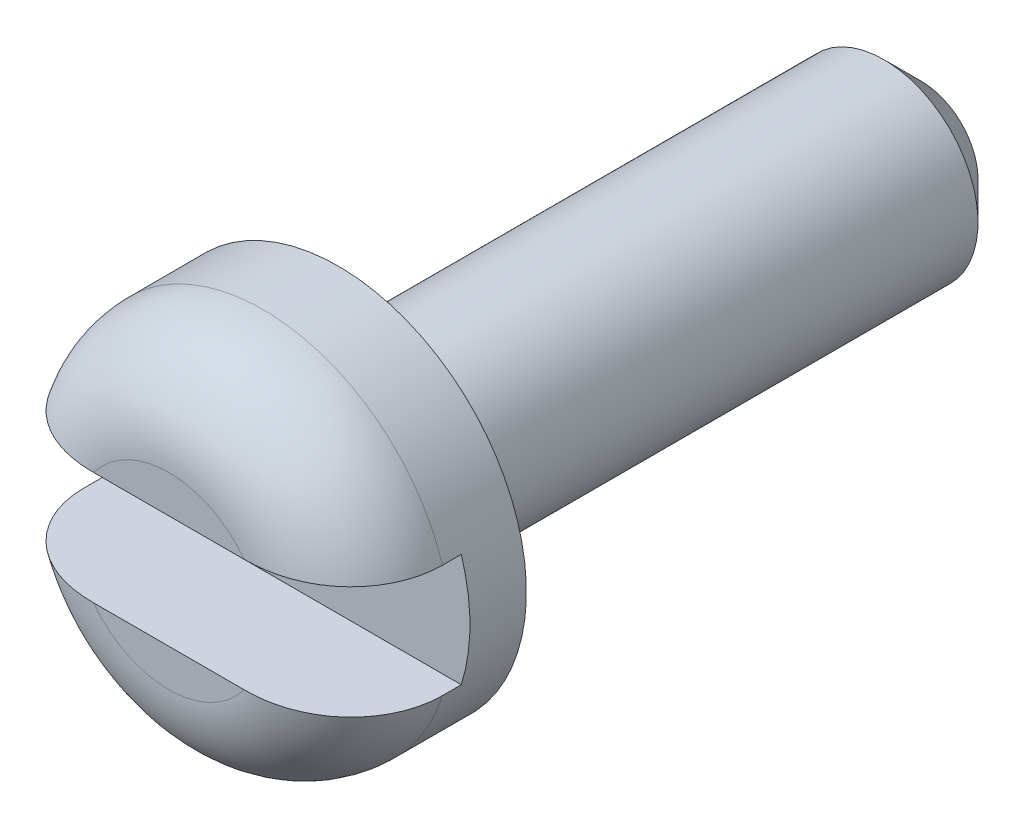
ISO-10303-21;
HEADER;
FILE_DESCRIPTION(('STEP AP214'),'2;1');
FILE_NAME('part.step','',(''),(''),'','','');
FILE_SCHEMA(('AUTOMOTIVE_DESIGN { 1 0 10303 214 1 1 1 1 }'));
ENDSEC;
DATA;
#1=APPLICATION_CONTEXT('core data for automotive mechanical design processes');
#2=APPLICATION_PROTOCOL_DEFINITION('international standard','automotive_design',2000,#1);
#3=PRODUCT_CONTEXT('',#1,'mechanical');
#4=PRODUCT('Part','Part','',(#3));
#5=PRODUCT_RELATED_PRODUCT_CATEGORY('part','',(#4));
#6=PRODUCT_DEFINITION_FORMATION('','',#4);
#7=PRODUCT_DEFINITION_CONTEXT('part definition',#1,'design');
#8=PRODUCT_DEFINITION('design','',#6,#7);
#9=PRODUCT_DEFINITION_SHAPE('','',#8);
#10=(LENGTH_UNIT() NAMED_UNIT(*) SI_UNIT(.MILLI.,.METRE.));
#11=(NAMED_UNIT(*) PLANE_ANGLE_UNIT() SI_UNIT($,.RADIAN.));
#12=(NAMED_UNIT(*) SI_UNIT($,.STERADIAN.) SOLID_ANGLE_UNIT());
#13=UNCERTAINTY_MEASURE_WITH_UNIT(LENGTH_MEASURE(1.E-05),#10,'distance_accuracy_value','');
#14=(GEOMETRIC_REPRESENTATION_CONTEXT(3) GLOBAL_UNCERTAINTY_ASSIGNED_CONTEXT((#13)) GLOBAL_UNIT_ASSIGNED_CONTEXT((#10,
#11,#12)) REPRESENTATION_CONTEXT('',''));
#15=CARTESIAN_POINT('',(0.,0.,0.));
#16=DIRECTION('',(0.,0.,1.));
#17=DIRECTION('',(1.,0.,0.));
#18=AXIS2_PLACEMENT_3D('',#15,#16,#17);
#19=CARTESIAN_POINT('',(0.,0.,0.));
#20=DIRECTION('',(0.,0.,1.));
#21=DIRECTION('',(1.,0.,0.));
#22=AXIS2_PLACEMENT_3D('',#19,#20,#21);
#23=PLANE('',#22);
#24=DIRECTION('',(1.,0.,0.));
#25=VECTOR('',#24,1.);
#26=CARTESIAN_POINT('',(-2.,-0.6,0.));
#27=LINE('',#26,#25);
#28=CARTESIAN_POINT('',(-0.8,-0.6,0.));
#29=VERTEX_POINT('',#28);
#30=CARTESIAN_POINT('',(0.8,-0.6,0.));
#31=VERTEX_POINT('',#30);
#32=EDGE_CURVE('E124',#29,#31,#27,.T.);
#33=ORIENTED_EDGE('',*,*,#32,.F.);
#34=CARTESIAN_POINT('',(0.,0.,0.));
#35=DIRECTION('',(0.,0.,1.));
#36=DIRECTION('',(1.,0.,0.));
#37=AXIS2_PLACEMENT_3D('',#34,#35,#36);
#38=CIRCLE('',#37,1.);
#39=EDGE_CURVE('E140',#29,#31,#38,.T.);
#40=ORIENTED_EDGE('',*,*,#39,.T.);
#41=EDGE_LOOP('',(#33,#40));
#42=FACE_BOUND('',#41,.T.);
#43=ADVANCED_FACE('F34',(#42),#23,.T.);
#44=DIRECTION('',(1.,0.,0.));
#45=VECTOR('',#44,1.);
#46=CARTESIAN_POINT('',(-2.,0.6,0.));
#47=LINE('',#46,#45);
#48=CARTESIAN_POINT('',(-0.8,0.6,0.));
#49=VERTEX_POINT('',#48);
#50=CARTESIAN_POINT('',(0.8,0.6,0.));
#51=VERTEX_POINT('',#50);
#52=EDGE_CURVE('E106',#49,#51,#47,.T.);
#53=ORIENTED_EDGE('',*,*,#52,.T.);
#54=CARTESIAN_POINT('',(0.,0.,0.));
#55=DIRECTION('',(0.,0.,1.));
#56=DIRECTION('',(1.,0.,0.));
#57=AXIS2_PLACEMENT_3D('',#54,#55,#56);
#58=CIRCLE('',#57,1.);
#59=EDGE_CURVE('E55',#51,#49,#58,.T.);
#60=ORIENTED_EDGE('',*,*,#59,.T.);
#61=EDGE_LOOP('',(#53,#60));
#62=FACE_BOUND('',#61,.T.);
#63=ADVANCED_FACE('F188',(#62),#23,.T.);
#64=CARTESIAN_POINT('',(0.,0.,-8.));
#65=DIRECTION('',(0.,0.,-1.));
#66=DIRECTION('',(-1.,0.,0.));
#67=AXIS2_PLACEMENT_3D('',#64,#65,#66);
#68=CYLINDRICAL_SURFACE('',#67,2.);
#69=DIRECTION('',(0.,0.,-1.));
#70=VECTOR('',#69,1.);
#71=CARTESIAN_POINT('',(1.90787840283389,-0.6,-8.));
#72=LINE('',#71,#70);
#73=CARTESIAN_POINT('',(1.90787840283389,-0.6,-0.999999999999999));
#74=VERTEX_POINT('',#73);
#75=CARTESIAN_POINT('',(1.90787840283389,-0.6,-1.2));
#76=VERTEX_POINT('',#75);
#77=EDGE_CURVE('E97',#74,#76,#72,.T.);
#78=ORIENTED_EDGE('',*,*,#77,.F.);
#79=CARTESIAN_POINT('',(0.,0.,-0.999999999999998));
#80=DIRECTION('',(0.,0.,1.));
#81=DIRECTION('',(1.,0.,0.));
#82=AXIS2_PLACEMENT_3D('',#79,#80,#81);
#83=CIRCLE('',#82,2.);
#84=CARTESIAN_POINT('',(-1.90787840283389,-0.6,-0.999999999999999));
#85=VERTEX_POINT('',#84);
#86=EDGE_CURVE('E141',#74,#85,#83,.F.);
#87=ORIENTED_EDGE('',*,*,#86,.T.);
#88=DIRECTION('',(0.,0.,-1.));
#89=VECTOR('',#88,1.);
#90=CARTESIAN_POINT('',(-1.90787840283389,-0.6,-8.));
#91=LINE('',#90,#89);
#92=CARTESIAN_POINT('',(-1.90787840283389,-0.6,-1.2));
#93=VERTEX_POINT('',#92);
#94=EDGE_CURVE('E114',#93,#85,#91,.F.);
#95=ORIENTED_EDGE('',*,*,#94,.F.);
#96=CARTESIAN_POINT('',(0.,0.,-1.2));
#97=DIRECTION('',(0.,0.,-1.));
#98=DIRECTION('',(-1.,0.,0.));
#99=AXIS2_PLACEMENT_3D('',#96,#97,#98);
#100=CIRCLE('',#99,2.);
#101=CARTESIAN_POINT('',(-1.90787840283389,0.6,-1.2));
#102=VERTEX_POINT('',#101);
#103=EDGE_CURVE('E98',#102,#93,#100,.F.);
#104=ORIENTED_EDGE('',*,*,#103,.F.);
#105=DIRECTION('',(0.,0.,-1.));
#106=VECTOR('',#105,1.);
#107=CARTESIAN_POINT('',(-1.90787840283389,0.6,-8.));
#108=LINE('',#107,#106);
#109=CARTESIAN_POINT('',(-1.90787840283389,0.6,-0.999999999999999));
#110=VERTEX_POINT('',#109);
#111=EDGE_CURVE('E86',#110,#102,#108,.T.);
#112=ORIENTED_EDGE('',*,*,#111,.F.);
#113=CARTESIAN_POINT('',(0.,0.,-1.));
#114=DIRECTION('',(0.,0.,1.));
#115=DIRECTION('',(1.,0.,0.));
#116=AXIS2_PLACEMENT_3D('',#113,#114,#115);
#117=CIRCLE('',#116,2.);
#118=CARTESIAN_POINT('',(1.90787840283389,0.6,-0.999999999999999));
#119=VERTEX_POINT('',#118);
#120=EDGE_CURVE('E144',#110,#119,#117,.F.);
#121=ORIENTED_EDGE('',*,*,#120,.T.);
#122=DIRECTION('',(0.,0.,-1.));
#123=VECTOR('',#122,1.);
#124=CARTESIAN_POINT('',(1.90787840283389,0.6,-8.));
#125=LINE('',#124,#123);
#126=CARTESIAN_POINT('',(1.90787840283389,0.6,-1.2));
#127=VERTEX_POINT('',#126);
#128=EDGE_CURVE('E115',#127,#119,#125,.F.);
#129=ORIENTED_EDGE('',*,*,#128,.F.);
#130=EDGE_CURVE('E105',#76,#127,#100,.F.);
#131=ORIENTED_EDGE('',*,*,#130,.F.);
#132=EDGE_LOOP('',(#78,#87,#95,#104,#112,#121,#129,#131));
#133=FACE_BOUND('',#132,.T.);
#134=CARTESIAN_POINT('',(0.,0.,-1.8));
#135=DIRECTION('',(0.,0.,-1.));
#136=DIRECTION('',(-1.,0.,0.));
#137=AXIS2_PLACEMENT_3D('',#134,#135,#136);
#138=CIRCLE('',#137,2.);
#139=CARTESIAN_POINT('',(-2.,0.,-1.8));
#140=VERTEX_POINT('',#139);
#141=EDGE_CURVE('E119',#140,#140,#138,.T.);
#142=ORIENTED_EDGE('',*,*,#141,.F.);
#143=EDGE_LOOP('',(#142));
#144=FACE_BOUND('',#143,.T.);
#145=ADVANCED_FACE('F110',(#133,#144),#68,.T.);
#146=CARTESIAN_POINT('',(-2.,0.,-1.8));
#147=DIRECTION('',(0.,0.,-1.));
#148=DIRECTION('',(-1.,0.,0.));
#149=AXIS2_PLACEMENT_3D('',#146,#147,#148);
#150=PLANE('',#149);
#151=CARTESIAN_POINT('',(0.,0.,-1.8));
#152=DIRECTION('',(0.,0.,-1.));
#153=DIRECTION('',(-1.,0.,0.));
#154=AXIS2_PLACEMENT_3D('',#151,#152,#153);
#155=CIRCLE('',#154,1.4);
#156=CARTESIAN_POINT('',(-1.4,0.,-1.8));
#157=VERTEX_POINT('',#156);
#158=EDGE_CURVE('E11',#157,#157,#155,.F.);
#159=ORIENTED_EDGE('',*,*,#158,.T.);
#160=EDGE_LOOP('',(#159));
#161=FACE_BOUND('',#160,.T.);
#162=ORIENTED_EDGE('',*,*,#141,.T.);
#163=EDGE_LOOP('',(#162));
#164=FACE_BOUND('',#163,.T.);
#165=ADVANCED_FACE('F219',(#161,#164),#150,.T.);
#166=CARTESIAN_POINT('',(0.,0.,-8.));
#167=DIRECTION('',(0.,0.,-1.));
#168=DIRECTION('',(-1.,0.,0.));
#169=AXIS2_PLACEMENT_3D('',#166,#167,#168);
#170=CYLINDRICAL_SURFACE('',#169,1.);
#171=CARTESIAN_POINT('',(0.,0.,-2.2));
#172=DIRECTION('',(0.,0.,-1.));
#173=DIRECTION('',(-1.,0.,0.));
#174=AXIS2_PLACEMENT_3D('',#171,#172,#173);
#175=CIRCLE('',#174,1.);
#176=CARTESIAN_POINT('',(-1.,0.,-2.2));
#177=VERTEX_POINT('',#176);
#178=EDGE_CURVE('E42',#177,#177,#175,.T.);
#179=ORIENTED_EDGE('',*,*,#178,.T.);
#180=EDGE_LOOP('',(#179));
#181=FACE_BOUND('',#180,.T.);
#182=CARTESIAN_POINT('',(0.,0.,-7.6));
#183=DIRECTION('',(0.,0.,-1.));
#184=DIRECTION('',(-1.,0.,0.));
#185=AXIS2_PLACEMENT_3D('',#182,#183,#184);
#186=CIRCLE('',#185,1.);
#187=CARTESIAN_POINT('',(-0.999999999999999,0.,-7.6));
#188=VERTEX_POINT('',#187);
#189=EDGE_CURVE('E202',#188,#188,#186,.F.);
#190=ORIENTED_EDGE('',*,*,#189,.T.);
#191=EDGE_LOOP('',(#190));
#192=FACE_BOUND('',#191,.T.);
#193=ADVANCED_FACE('F214',(#181,#192),#170,.T.);
#194=CARTESIAN_POINT('',(-0.999999999999998,0.,-8.));
#195=DIRECTION('',(0.,0.,-1.));
#196=DIRECTION('',(-1.,0.,0.));
#197=AXIS2_PLACEMENT_3D('',#194,#195,#196);
#198=PLANE('',#197);
#199=CARTESIAN_POINT('',(0.,0.,-8.));
#200=DIRECTION('',(0.,0.,-1.));
#201=DIRECTION('',(-1.,0.,0.));
#202=AXIS2_PLACEMENT_3D('',#199,#200,#201);
#203=CIRCLE('',#202,0.6);
#204=CARTESIAN_POINT('',(-0.599999999999998,0.,-8.));
#205=VERTEX_POINT('',#204);
#206=EDGE_CURVE('E205',#205,#205,#203,.T.);
#207=ORIENTED_EDGE('',*,*,#206,.T.);
#208=EDGE_LOOP('',(#207));
#209=FACE_BOUND('',#208,.T.);
#210=ADVANCED_FACE('F218',(#209),#198,.T.);
#211=CARTESIAN_POINT('',(-2.,0.6,-1.2));
#212=DIRECTION('',(0.,0.,-1.));
#213=DIRECTION('',(-1.,0.,0.));
#214=AXIS2_PLACEMENT_3D('',#211,#212,#213);
#215=PLANE('',#214);
#216=DIRECTION('',(1.,0.,0.));
#217=VECTOR('',#216,1.);
#218=CARTESIAN_POINT('',(-2.,-0.6,-1.2));
#219=LINE('',#218,#217);
#220=EDGE_CURVE('E121',#93,#76,#219,.T.);
#221=ORIENTED_EDGE('',*,*,#220,.T.);
#222=ORIENTED_EDGE('',*,*,#130,.T.);
#223=DIRECTION('',(1.,0.,0.));
#224=VECTOR('',#223,1.);
#225=CARTESIAN_POINT('',(-2.,0.6,-1.2));
#226=LINE('',#225,#224);
#227=EDGE_CURVE('E89',#102,#127,#226,.T.);
#228=ORIENTED_EDGE('',*,*,#227,.F.);
#229=ORIENTED_EDGE('',*,*,#103,.T.);
#230=EDGE_LOOP('',(#221,#222,#228,#229));
#231=FACE_BOUND('',#230,.T.);
#232=ADVANCED_FACE('F102',(#231),#215,.F.);
#233=CARTESIAN_POINT('',(-2.,-0.6,0.));
#234=DIRECTION('',(0.,-1.,0.));
#235=DIRECTION('',(0.,0.,-1.));
#236=AXIS2_PLACEMENT_3D('',#233,#234,#235);
#237=PLANE('',#236);
#238=ORIENTED_EDGE('',*,*,#94,.T.);
#239=CARTESIAN_POINT('',(-1.90787840283389,-0.6,-1.));
#240=CARTESIAN_POINT('',(-1.90787854907988,-0.6,-0.972959130771586));
#241=CARTESIAN_POINT('',(-1.90672787533789,-0.6,-0.945931393585368));
#242=CARTESIAN_POINT('',(-1.90213965871633,-0.6,-0.892073352579564));
#243=CARTESIAN_POINT('',(-1.89870233629077,-0.6,-0.865243029979482));
#244=CARTESIAN_POINT('',(-1.88500553439201,-0.6,-0.785432939642535));
#245=CARTESIAN_POINT('',(-1.87136104202504,-0.6,-0.732994457844584));
#246=CARTESIAN_POINT('',(-1.83547723787583,-0.6,-0.631166383290867));
#247=CARTESIAN_POINT('',(-1.81323587663703,-0.6,-0.581777520809764));
#248=CARTESIAN_POINT('',(-1.76086428746498,-0.6,-0.487366203130675));
#249=CARTESIAN_POINT('',(-1.73073279716015,-0.6,-0.442344448223799));
#250=CARTESIAN_POINT('',(-1.66312688530897,-0.6,-0.357337576737432));
#251=CARTESIAN_POINT('',(-1.62557004752264,-0.6,-0.317418129279802));
#252=CARTESIAN_POINT('',(-1.54452503832071,-0.6,-0.244192208616092));
#253=CARTESIAN_POINT('',(-1.50103871840768,-0.6,-0.210883679067726));
#254=CARTESIAN_POINT('',(-1.40764162770773,-0.6,-0.15034951232542));
#255=CARTESIAN_POINT('',(-1.35754855323435,-0.6,-0.123405812779762));
#256=CARTESIAN_POINT('',(-1.25373724805451,-0.6,-0.0775813762054164));
#257=CARTESIAN_POINT('',(-1.20001320021334,-0.6,-0.0587139504693381));
#258=CARTESIAN_POINT('',(-1.08894741476526,-0.6,-0.028583974322069));
#259=CARTESIAN_POINT('',(-1.03154740702986,-0.6,-0.0175376622486418));
#260=CARTESIAN_POINT('',(-0.94489821676314,-0.6,-0.00681830415335212));
#261=CARTESIAN_POINT('',(-0.91596905999246,-0.6,-0.00421972325925796));
#262=CARTESIAN_POINT('',(-0.858026852466926,-0.6,-0.000809343249861463));
#263=CARTESIAN_POINT('',(-0.82901388553351,-0.6,3.8587869620577E-06));
#264=CARTESIAN_POINT('',(-0.8,-0.6,0.));
#265=B_SPLINE_CURVE_WITH_KNOTS('',3,(#239,#240,#241,#242,#243,#244,#245,#246,#247,#248,#249,
#250,#251,#252,#253,#254,#255,#256,#257,#258,#259,#260,#261,#262,#263,#264),.UNSPECIFIED.,.F.,
.F.,(4,2,2,2,2,2,2,2,2,2,2,2,4),(0.,0.0810721414036495,0.16213646783801,0.323851745437421,
0.485605599064872,0.647385348132203,0.811073248357706,0.974710152987553,1.14461630154657,
1.31480142065062,1.4895253002468,1.57661664192148,1.66363952411327),.UNSPECIFIED.);
#266=EDGE_CURVE('E134',#85,#29,#265,.T.);
#267=ORIENTED_EDGE('',*,*,#266,.T.);
#268=ORIENTED_EDGE('',*,*,#32,.T.);
#269=CARTESIAN_POINT('',(0.8,-0.6,0.));
#270=CARTESIAN_POINT('',(0.838394836130352,-0.6,1.99528027400295E-05));
#271=CARTESIAN_POINT('',(0.876818260827937,-0.6,-0.00141609976624534));
#272=CARTESIAN_POINT('',(0.953479794413814,-0.6,-0.00749671073618988));
#273=CARTESIAN_POINT('',(0.991717409766061,-0.6,-0.0121473864561444));
#274=CARTESIAN_POINT('',(1.06772952552836,-0.6,-0.0249752264162009));
#275=CARTESIAN_POINT('',(1.10550229626654,-0.6,-0.0331629090048541));
#276=CARTESIAN_POINT('',(1.18002220545577,-0.6,-0.0532083718127095));
#277=CARTESIAN_POINT('',(1.21677020491699,-0.6,-0.0650629632106258));
#278=CARTESIAN_POINT('',(1.30802367231534,-0.6,-0.0998313714610998));
#279=CARTESIAN_POINT('',(1.36159604248338,-0.6,-0.125275046228604));
#280=CARTESIAN_POINT('',(1.46361714671382,-0.6,-0.184704245017752));
#281=CARTESIAN_POINT('',(1.51207733492179,-0.6,-0.218670071300597));
#282=CARTESIAN_POINT('',(1.60255973623095,-0.6,-0.294632564888441));
#283=CARTESIAN_POINT('',(1.6445583832862,-0.6,-0.336657429053831));
#284=CARTESIAN_POINT('',(1.72041826417234,-0.6,-0.427581025378005));
#285=CARTESIAN_POINT('',(1.75427320041993,-0.6,-0.476485031205252));
#286=CARTESIAN_POINT('',(1.81087578852468,-0.6,-0.576693751794348));
#287=CARTESIAN_POINT('',(1.83414423155863,-0.6,-0.627705291455655));
#288=CARTESIAN_POINT('',(1.87145598656546,-0.6,-0.732953582700387));
#289=CARTESIAN_POINT('',(1.88551296563659,-0.6,-0.787185425311305));
#290=CARTESIAN_POINT('',(1.89911123482771,-0.6,-0.868258802742182));
#291=CARTESIAN_POINT('',(1.90239870195693,-0.6,-0.894520196981086));
#292=CARTESIAN_POINT('',(1.9067803602153,-0.6,-0.947183375692414));
#293=CARTESIAN_POINT('',(1.90787802286924,-0.6,-0.973584871319161));
#294=CARTESIAN_POINT('',(1.90787840283389,-0.6,-0.999999999999999));
#295=B_SPLINE_CURVE_WITH_KNOTS('',3,(#269,#270,#271,#272,#273,#274,#275,#276,#277,#278,#279,
#280,#281,#282,#283,#284,#285,#286,#287,#288,#289,#290,#291,#292,#293,#294),.UNSPECIFIED.,.F.,
.F.,(4,2,2,2,2,2,2,2,2,2,2,2,4),(0.,0.115198607746711,0.230617040251845,0.346381092640411,
0.462044755850716,0.63913023348533,0.815810114307278,0.993119826953101,1.17056621667914,
1.33795510555166,1.50509507290818,1.58441647905369,1.6636120357231),.UNSPECIFIED.);
#296=EDGE_CURVE('E133',#31,#74,#295,.T.);
#297=ORIENTED_EDGE('',*,*,#296,.T.);
#298=ORIENTED_EDGE('',*,*,#77,.T.);
#299=ORIENTED_EDGE('',*,*,#220,.F.);
#300=EDGE_LOOP('',(#238,#267,#268,#297,#298,#299));
#301=FACE_BOUND('',#300,.T.);
#302=ADVANCED_FACE('F132',(#301),#237,.F.);
#303=CARTESIAN_POINT('',(-2.,0.6,0.));
#304=DIRECTION('',(0.,1.,0.));
#305=DIRECTION('',(0.,0.,1.));
#306=AXIS2_PLACEMENT_3D('',#303,#304,#305);
#307=PLANE('',#306);
#308=ORIENTED_EDGE('',*,*,#128,.T.);
#309=CARTESIAN_POINT('',(1.90787840283389,0.6,-0.999999999999999));
#310=CARTESIAN_POINT('',(1.90787854907989,0.6,-0.972959130771585));
#311=CARTESIAN_POINT('',(1.90672787533789,0.6,-0.945931393585367));
#312=CARTESIAN_POINT('',(1.90213965871633,0.6,-0.892073352579563));
#313=CARTESIAN_POINT('',(1.89870233629077,0.6,-0.865243029979481));
#314=CARTESIAN_POINT('',(1.88500553439201,0.6,-0.785432939642534));
#315=CARTESIAN_POINT('',(1.87136104202504,0.6,-0.732994457844583));
#316=CARTESIAN_POINT('',(1.83547723787583,0.6,-0.631166383290866));
#317=CARTESIAN_POINT('',(1.81323587663703,0.6,-0.581777520809764));
#318=CARTESIAN_POINT('',(1.76086428746498,0.6,-0.487366203130674));
#319=CARTESIAN_POINT('',(1.73073279716015,0.6,-0.442344448223798));
#320=CARTESIAN_POINT('',(1.66312688530897,0.6,-0.357337576737431));
#321=CARTESIAN_POINT('',(1.62557004752264,0.6,-0.317418129279802));
#322=CARTESIAN_POINT('',(1.54452503832071,0.6,-0.244192208616091));
#323=CARTESIAN_POINT('',(1.50103871840768,0.6,-0.210883679067726));
#324=CARTESIAN_POINT('',(1.40764162770773,0.6,-0.15034951232542));
#325=CARTESIAN_POINT('',(1.35754855323435,0.6,-0.123405812779761));
#326=CARTESIAN_POINT('',(1.25373724805451,0.6,-0.0775813762054156));
#327=CARTESIAN_POINT('',(1.20001320021334,0.6,-0.0587139504693376));
#328=CARTESIAN_POINT('',(1.08894741476526,0.6,-0.0285839743220685));
#329=CARTESIAN_POINT('',(1.03154740702986,0.6,-0.017537662248641));
#330=CARTESIAN_POINT('',(0.94489821676314,0.6,-0.00681830415335162));
#331=CARTESIAN_POINT('',(0.91596905999246,0.6,-0.00421972325925767));
#332=CARTESIAN_POINT('',(0.858026852466926,0.6,-0.000809343249861369));
#333=CARTESIAN_POINT('',(0.82901388553351,0.6,3.85878696215575E-06));
#334=CARTESIAN_POINT('',(0.8,0.6,0.));
#335=B_SPLINE_CURVE_WITH_KNOTS('',3,(#309,#310,#311,#312,#313,#314,#315,#316,#317,#318,#319,
#320,#321,#322,#323,#324,#325,#326,#327,#328,#329,#330,#331,#332,#333,#334),.UNSPECIFIED.,.F.,
.F.,(4,2,2,2,2,2,2,2,2,2,2,2,4),(0.,0.0810721414036495,0.16213646783801,0.323851745437421,
0.485605599064872,0.647385348132202,0.811073248357706,0.974710152987553,1.14461630154657,
1.31480142065062,1.4895253002468,1.57661664192148,1.66363952411327),.UNSPECIFIED.);
#336=EDGE_CURVE('E49',#119,#51,#335,.T.);
#337=ORIENTED_EDGE('',*,*,#336,.T.);
#338=ORIENTED_EDGE('',*,*,#52,.F.);
#339=CARTESIAN_POINT('',(-0.8,0.6,0.));
#340=CARTESIAN_POINT('',(-0.838394836130352,0.6,1.99528027396421E-05));
#341=CARTESIAN_POINT('',(-0.876818260827937,0.6,-0.00141609976624574));
#342=CARTESIAN_POINT('',(-0.953479794413814,0.6,-0.0074967107361903));
#343=CARTESIAN_POINT('',(-0.991717409766061,0.6,-0.0121473864561448));
#344=CARTESIAN_POINT('',(-1.06772952552836,0.6,-0.0249752264162013));
#345=CARTESIAN_POINT('',(-1.10550229626654,0.6,-0.0331629090048544));
#346=CARTESIAN_POINT('',(-1.18002220545577,0.6,-0.0532083718127098));
#347=CARTESIAN_POINT('',(-1.21677020491699,0.6,-0.0650629632106261));
#348=CARTESIAN_POINT('',(-1.30802367231534,0.6,-0.0998313714611001));
#349=CARTESIAN_POINT('',(-1.36159604248338,0.6,-0.125275046228604));
#350=CARTESIAN_POINT('',(-1.46361714671382,0.6,-0.184704245017752));
#351=CARTESIAN_POINT('',(-1.51207733492179,0.6,-0.218670071300597));
#352=CARTESIAN_POINT('',(-1.60255973623095,0.6,-0.294632564888441));
#353=CARTESIAN_POINT('',(-1.6445583832862,0.6,-0.336657429053832));
#354=CARTESIAN_POINT('',(-1.72041826417234,0.6,-0.427581025378006));
#355=CARTESIAN_POINT('',(-1.75427320041993,0.6,-0.476485031205253));
#356=CARTESIAN_POINT('',(-1.81087578852468,0.6,-0.576693751794349));
#357=CARTESIAN_POINT('',(-1.83414423155863,0.6,-0.627705291455656));
#358=CARTESIAN_POINT('',(-1.87145598656546,0.6,-0.732953582700388));
#359=CARTESIAN_POINT('',(-1.88551296563659,0.6,-0.787185425311305));
#360=CARTESIAN_POINT('',(-1.89911123482771,0.6,-0.868258802742183));
#361=CARTESIAN_POINT('',(-1.90239870195693,0.6,-0.894520196981087));
#362=CARTESIAN_POINT('',(-1.9067803602153,0.6,-0.947183375692415));
#363=CARTESIAN_POINT('',(-1.90787802286924,0.6,-0.973584871319162));
#364=CARTESIAN_POINT('',(-1.90787840283389,0.6,-1.));
#365=B_SPLINE_CURVE_WITH_KNOTS('',3,(#339,#340,#341,#342,#343,#344,#345,#346,#347,#348,#349,
#350,#351,#352,#353,#354,#355,#356,#357,#358,#359,#360,#361,#362,#363,#364),.UNSPECIFIED.,.F.,
.F.,(4,2,2,2,2,2,2,2,2,2,2,2,4),(0.,0.115198607746711,0.230617040251845,0.346381092640411,
0.462044755850716,0.639130233485329,0.815810114307278,0.9931198269531,1.17056621667914,
1.33795510555166,1.50509507290818,1.58441647905369,1.6636120357231),.UNSPECIFIED.);
#366=EDGE_CURVE('E92',#49,#110,#365,.T.);
#367=ORIENTED_EDGE('',*,*,#366,.T.);
#368=ORIENTED_EDGE('',*,*,#111,.T.);
#369=ORIENTED_EDGE('',*,*,#227,.T.);
#370=EDGE_LOOP('',(#308,#337,#338,#367,#368,#369));
#371=FACE_BOUND('',#370,.T.);
#372=ADVANCED_FACE('F88',(#371),#307,.F.);
#373=CARTESIAN_POINT('',(0.,0.,-8.));
#374=DIRECTION('',(0.,0.,1.));
#375=DIRECTION('',(1.,0.,0.));
#376=AXIS2_PLACEMENT_3D('',#373,#374,#375);
#377=CONICAL_SURFACE('',#376,0.6,0.785398163397448);
#378=ORIENTED_EDGE('',*,*,#189,.F.);
#379=EDGE_LOOP('',(#378));
#380=FACE_BOUND('',#379,.T.);
#381=ORIENTED_EDGE('',*,*,#206,.F.);
#382=EDGE_LOOP('',(#381));
#383=FACE_BOUND('',#382,.T.);
#384=ADVANCED_FACE('F165',(#380,#383),#377,.T.);
#385=CARTESIAN_POINT('',(0.,0.,-0.999999999999999));
#386=DIRECTION('',(0.,0.,1.));
#387=DIRECTION('',(1.,0.,0.));
#388=AXIS2_PLACEMENT_3D('',#385,#386,#387);
#389=DEGENERATE_TOROIDAL_SURFACE('',#388,1.,1.,.T.);
#390=ORIENTED_EDGE('',*,*,#296,.F.);
#391=ORIENTED_EDGE('',*,*,#39,.F.);
#392=ORIENTED_EDGE('',*,*,#266,.F.);
#393=ORIENTED_EDGE('',*,*,#86,.F.);
#394=EDGE_LOOP('',(#390,#391,#392,#393));
#395=FACE_BOUND('',#394,.T.);
#396=ADVANCED_FACE('F139',(#395),#389,.T.);
#397=CARTESIAN_POINT('',(0.,0.,-0.999999999999999));
#398=DIRECTION('',(0.,0.,1.));
#399=DIRECTION('',(1.,0.,0.));
#400=AXIS2_PLACEMENT_3D('',#397,#398,#399);
#401=DEGENERATE_TOROIDAL_SURFACE('',#400,1.,1.,.T.);
#402=ORIENTED_EDGE('',*,*,#366,.F.);
#403=ORIENTED_EDGE('',*,*,#59,.F.);
#404=ORIENTED_EDGE('',*,*,#336,.F.);
#405=ORIENTED_EDGE('',*,*,#120,.F.);
#406=EDGE_LOOP('',(#402,#403,#404,#405));
#407=FACE_BOUND('',#406,.T.);
#408=ADVANCED_FACE('F177',(#407),#401,.T.);
#409=CARTESIAN_POINT('',(0.,0.,-2.2));
#410=DIRECTION('',(0.,0.,-1.));
#411=DIRECTION('',(-1.,0.,0.));
#412=AXIS2_PLACEMENT_3D('',#409,#410,#411);
#413=TOROIDAL_SURFACE('',#412,1.4,0.4);
#414=ORIENTED_EDGE('',*,*,#158,.F.);
#415=EDGE_LOOP('',(#414));
#416=FACE_BOUND('',#415,.T.);
#417=ORIENTED_EDGE('',*,*,#178,.F.);
#418=EDGE_LOOP('',(#417));
#419=FACE_BOUND('',#418,.T.);
#420=ADVANCED_FACE('F36',(#416,#419),#413,.F.);
#421=CLOSED_SHELL('',(#43,#63,#145,#165,#193,#210,#232,#302,#372,#384,#396,#408,#420));
#422=MANIFOLD_SOLID_BREP('B2',#421);
#423=ADVANCED_BREP_SHAPE_REPRESENTATION('',(#18,#422),#14);
#424=SHAPE_DEFINITION_REPRESENTATION(#9,#423);
ENDSEC;
END-ISO-10303-21;
